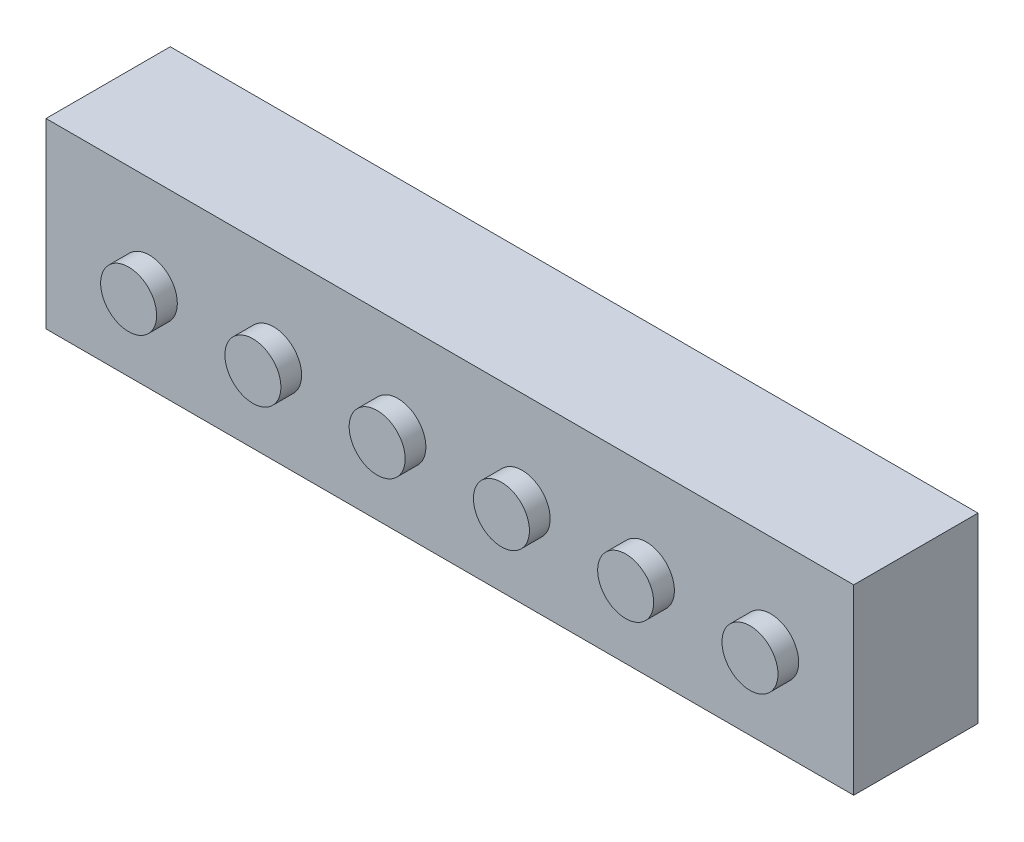
ISO-10303-21;
HEADER;
FILE_DESCRIPTION(('STEP AP214'),'2;1');
FILE_NAME('part.step','',(''),(''),'','','');
FILE_SCHEMA(('AUTOMOTIVE_DESIGN { 1 0 10303 214 1 1 1 1 }'));
ENDSEC;
DATA;
#1=APPLICATION_CONTEXT('core data for automotive mechanical design processes');
#2=APPLICATION_PROTOCOL_DEFINITION('international standard','automotive_design',2000,#1);
#3=PRODUCT_CONTEXT('',#1,'mechanical');
#4=PRODUCT('Part','Part','',(#3));
#5=PRODUCT_RELATED_PRODUCT_CATEGORY('part','',(#4));
#6=PRODUCT_DEFINITION_FORMATION('','',#4);
#7=PRODUCT_DEFINITION_CONTEXT('part definition',#1,'design');
#8=PRODUCT_DEFINITION('design','',#6,#7);
#9=PRODUCT_DEFINITION_SHAPE('','',#8);
#10=(LENGTH_UNIT() NAMED_UNIT(*) SI_UNIT(.MILLI.,.METRE.));
#11=(NAMED_UNIT(*) PLANE_ANGLE_UNIT() SI_UNIT($,.RADIAN.));
#12=(NAMED_UNIT(*) SI_UNIT($,.STERADIAN.) SOLID_ANGLE_UNIT());
#13=UNCERTAINTY_MEASURE_WITH_UNIT(LENGTH_MEASURE(1.E-05),#10,'distance_accuracy_value','');
#14=(GEOMETRIC_REPRESENTATION_CONTEXT(3) GLOBAL_UNCERTAINTY_ASSIGNED_CONTEXT((#13)) GLOBAL_UNIT_ASSIGNED_CONTEXT((#10,
#11,#12)) REPRESENTATION_CONTEXT('',''));
#15=CARTESIAN_POINT('',(0.,0.,0.));
#16=DIRECTION('',(0.,0.,1.));
#17=DIRECTION('',(1.,0.,0.));
#18=AXIS2_PLACEMENT_3D('',#15,#16,#17);
#19=CARTESIAN_POINT('',(157.430504542612,17.7049994128948,70.));
#20=DIRECTION('',(0.,0.,1.));
#21=DIRECTION('',(1.,0.,0.));
#22=AXIS2_PLACEMENT_3D('',#19,#20,#21);
#23=PLANE('',#22);
#24=CARTESIAN_POINT('',(157.430504542612,17.7049994128948,70.));
#25=DIRECTION('',(0.,0.,1.));
#26=DIRECTION('',(1.,0.,0.));
#27=AXIS2_PLACEMENT_3D('',#24,#25,#26);
#28=CIRCLE('',#27,13.5201178452894);
#29=CARTESIAN_POINT('',(170.950622387902,17.7049994128948,70.));
#30=VERTEX_POINT('',#29);
#31=EDGE_CURVE('E11',#30,#30,#28,.T.);
#32=ORIENTED_EDGE('',*,*,#31,.T.);
#33=EDGE_LOOP('',(#32));
#34=FACE_BOUND('',#33,.T.);
#35=ADVANCED_FACE('F39',(#34),#23,.T.);
#36=CARTESIAN_POINT('',(157.430504542612,17.7049994128948,70.));
#37=DIRECTION('',(0.,0.,-1.));
#38=DIRECTION('',(-1.,0.,0.));
#39=AXIS2_PLACEMENT_3D('',#36,#37,#38);
#40=CYLINDRICAL_SURFACE('',#39,13.5201178452894);
#41=ORIENTED_EDGE('',*,*,#31,.F.);
#42=EDGE_LOOP('',(#41));
#43=FACE_BOUND('',#42,.T.);
#44=CARTESIAN_POINT('',(157.430504542612,17.7049994128948,60.));
#45=DIRECTION('',(0.,0.,1.));
#46=DIRECTION('',(1.,0.,0.));
#47=AXIS2_PLACEMENT_3D('',#44,#45,#46);
#48=CIRCLE('',#47,13.5201178452894);
#49=CARTESIAN_POINT('',(170.950622387902,17.7049994128948,60.));
#50=VERTEX_POINT('',#49);
#51=EDGE_CURVE('E48',#50,#50,#48,.T.);
#52=ORIENTED_EDGE('',*,*,#51,.T.);
#53=EDGE_LOOP('',(#52));
#54=FACE_BOUND('',#53,.T.);
#55=ADVANCED_FACE('F156',(#43,#54),#40,.T.);
#56=CARTESIAN_POINT('',(97.4305045426122,17.7049994128948,70.));
#57=DIRECTION('',(0.,0.,1.));
#58=DIRECTION('',(1.,0.,0.));
#59=AXIS2_PLACEMENT_3D('',#56,#57,#58);
#60=PLANE('',#59);
#61=CARTESIAN_POINT('',(97.4305045426122,17.7049994128948,70.));
#62=DIRECTION('',(0.,0.,1.));
#63=DIRECTION('',(1.,0.,0.));
#64=AXIS2_PLACEMENT_3D('',#61,#62,#63);
#65=CIRCLE('',#64,13.5201178452894);
#66=CARTESIAN_POINT('',(110.950622387902,17.7049994128948,70.));
#67=VERTEX_POINT('',#66);
#68=EDGE_CURVE('E149',#67,#67,#65,.T.);
#69=ORIENTED_EDGE('',*,*,#68,.T.);
#70=EDGE_LOOP('',(#69));
#71=FACE_BOUND('',#70,.T.);
#72=ADVANCED_FACE('F179',(#71),#60,.T.);
#73=CARTESIAN_POINT('',(97.4305045426122,17.7049994128948,70.));
#74=DIRECTION('',(0.,0.,-1.));
#75=DIRECTION('',(-1.,0.,0.));
#76=AXIS2_PLACEMENT_3D('',#73,#74,#75);
#77=CYLINDRICAL_SURFACE('',#76,13.5201178452894);
#78=ORIENTED_EDGE('',*,*,#68,.F.);
#79=EDGE_LOOP('',(#78));
#80=FACE_BOUND('',#79,.T.);
#81=CARTESIAN_POINT('',(97.4305045426122,17.7049994128948,60.));
#82=DIRECTION('',(0.,0.,1.));
#83=DIRECTION('',(1.,0.,0.));
#84=AXIS2_PLACEMENT_3D('',#81,#82,#83);
#85=CIRCLE('',#84,13.5201178452894);
#86=CARTESIAN_POINT('',(110.950622387902,17.7049994128948,60.));
#87=VERTEX_POINT('',#86);
#88=EDGE_CURVE('E145',#87,#87,#85,.T.);
#89=ORIENTED_EDGE('',*,*,#88,.T.);
#90=EDGE_LOOP('',(#89));
#91=FACE_BOUND('',#90,.T.);
#92=ADVANCED_FACE('F185',(#80,#91),#77,.T.);
#93=CARTESIAN_POINT('',(37.4305045426122,17.7049994128948,70.));
#94=DIRECTION('',(0.,0.,1.));
#95=DIRECTION('',(1.,0.,0.));
#96=AXIS2_PLACEMENT_3D('',#93,#94,#95);
#97=PLANE('',#96);
#98=CARTESIAN_POINT('',(37.4305045426122,17.7049994128948,70.));
#99=DIRECTION('',(0.,0.,1.));
#100=DIRECTION('',(1.,0.,0.));
#101=AXIS2_PLACEMENT_3D('',#98,#99,#100);
#102=CIRCLE('',#101,13.5201178452894);
#103=CARTESIAN_POINT('',(50.9506223879016,17.7049994128948,70.));
#104=VERTEX_POINT('',#103);
#105=EDGE_CURVE('E141',#104,#104,#102,.T.);
#106=ORIENTED_EDGE('',*,*,#105,.T.);
#107=EDGE_LOOP('',(#106));
#108=FACE_BOUND('',#107,.T.);
#109=ADVANCED_FACE('F191',(#108),#97,.T.);
#110=CARTESIAN_POINT('',(37.4305045426122,17.7049994128948,70.));
#111=DIRECTION('',(0.,0.,-1.));
#112=DIRECTION('',(-1.,0.,0.));
#113=AXIS2_PLACEMENT_3D('',#110,#111,#112);
#114=CYLINDRICAL_SURFACE('',#113,13.5201178452894);
#115=ORIENTED_EDGE('',*,*,#105,.F.);
#116=EDGE_LOOP('',(#115));
#117=FACE_BOUND('',#116,.T.);
#118=CARTESIAN_POINT('',(37.4305045426122,17.7049994128948,60.));
#119=DIRECTION('',(0.,0.,1.));
#120=DIRECTION('',(1.,0.,0.));
#121=AXIS2_PLACEMENT_3D('',#118,#119,#120);
#122=CIRCLE('',#121,13.5201178452894);
#123=CARTESIAN_POINT('',(50.9506223879016,17.7049994128948,60.));
#124=VERTEX_POINT('',#123);
#125=EDGE_CURVE('E137',#124,#124,#122,.T.);
#126=ORIENTED_EDGE('',*,*,#125,.T.);
#127=EDGE_LOOP('',(#126));
#128=FACE_BOUND('',#127,.T.);
#129=ADVANCED_FACE('F195',(#117,#128),#114,.T.);
#130=CARTESIAN_POINT('',(-22.5694954573878,17.7049994128948,70.));
#131=DIRECTION('',(0.,0.,1.));
#132=DIRECTION('',(1.,0.,0.));
#133=AXIS2_PLACEMENT_3D('',#130,#131,#132);
#134=PLANE('',#133);
#135=CARTESIAN_POINT('',(-22.5694954573878,17.7049994128948,70.));
#136=DIRECTION('',(0.,0.,1.));
#137=DIRECTION('',(1.,0.,0.));
#138=AXIS2_PLACEMENT_3D('',#135,#136,#137);
#139=CIRCLE('',#138,13.5201178452894);
#140=CARTESIAN_POINT('',(-9.04937761209837,17.7049994128948,70.));
#141=VERTEX_POINT('',#140);
#142=EDGE_CURVE('E133',#141,#141,#139,.T.);
#143=ORIENTED_EDGE('',*,*,#142,.T.);
#144=EDGE_LOOP('',(#143));
#145=FACE_BOUND('',#144,.T.);
#146=ADVANCED_FACE('F199',(#145),#134,.T.);
#147=CARTESIAN_POINT('',(-22.5694954573878,17.7049994128948,70.));
#148=DIRECTION('',(0.,0.,-1.));
#149=DIRECTION('',(-1.,0.,0.));
#150=AXIS2_PLACEMENT_3D('',#147,#148,#149);
#151=CYLINDRICAL_SURFACE('',#150,13.5201178452894);
#152=ORIENTED_EDGE('',*,*,#142,.F.);
#153=EDGE_LOOP('',(#152));
#154=FACE_BOUND('',#153,.T.);
#155=CARTESIAN_POINT('',(-22.5694954573878,17.7049994128948,60.));
#156=DIRECTION('',(0.,0.,1.));
#157=DIRECTION('',(1.,0.,0.));
#158=AXIS2_PLACEMENT_3D('',#155,#156,#157);
#159=CIRCLE('',#158,13.5201178452894);
#160=CARTESIAN_POINT('',(-9.04937761209837,17.7049994128948,60.));
#161=VERTEX_POINT('',#160);
#162=EDGE_CURVE('E129',#161,#161,#159,.T.);
#163=ORIENTED_EDGE('',*,*,#162,.T.);
#164=EDGE_LOOP('',(#163));
#165=FACE_BOUND('',#164,.T.);
#166=ADVANCED_FACE('F203',(#154,#165),#151,.T.);
#167=CARTESIAN_POINT('',(-192.465,63.375,60.));
#168=DIRECTION('',(1.,0.,0.));
#169=DIRECTION('',(0.,0.,-1.));
#170=AXIS2_PLACEMENT_3D('',#167,#168,#169);
#171=PLANE('',#170);
#172=DIRECTION('',(0.,-1.,0.));
#173=VECTOR('',#172,1.);
#174=CARTESIAN_POINT('',(-192.465,63.375,0.));
#175=LINE('',#174,#173);
#176=CARTESIAN_POINT('',(-192.465,63.375,0.));
#177=VERTEX_POINT('',#176);
#178=CARTESIAN_POINT('',(-192.465,-24.625,0.));
#179=VERTEX_POINT('',#178);
#180=EDGE_CURVE('E112',#177,#179,#175,.T.);
#181=ORIENTED_EDGE('',*,*,#180,.T.);
#182=DIRECTION('',(0.,0.,-1.));
#183=VECTOR('',#182,1.);
#184=CARTESIAN_POINT('',(-192.465,-24.625,60.));
#185=LINE('',#184,#183);
#186=CARTESIAN_POINT('',(-192.465,-24.625,60.));
#187=VERTEX_POINT('',#186);
#188=EDGE_CURVE('E101',#187,#179,#185,.T.);
#189=ORIENTED_EDGE('',*,*,#188,.F.);
#190=DIRECTION('',(0.,-1.,0.));
#191=VECTOR('',#190,1.);
#192=CARTESIAN_POINT('',(-192.465,63.375,60.));
#193=LINE('',#192,#191);
#194=CARTESIAN_POINT('',(-192.465,63.375,60.));
#195=VERTEX_POINT('',#194);
#196=EDGE_CURVE('E93',#195,#187,#193,.T.);
#197=ORIENTED_EDGE('',*,*,#196,.F.);
#198=DIRECTION('',(0.,0.,-1.));
#199=VECTOR('',#198,1.);
#200=CARTESIAN_POINT('',(-192.465,63.375,60.));
#201=LINE('',#200,#199);
#202=EDGE_CURVE('E108',#195,#177,#201,.T.);
#203=ORIENTED_EDGE('',*,*,#202,.T.);
#204=EDGE_LOOP('',(#181,#189,#197,#203));
#205=FACE_BOUND('',#204,.T.);
#206=ADVANCED_FACE('F207',(#205),#171,.F.);
#207=CARTESIAN_POINT('',(-192.465,-24.625,60.));
#208=DIRECTION('',(0.,1.,0.));
#209=DIRECTION('',(0.,0.,1.));
#210=AXIS2_PLACEMENT_3D('',#207,#208,#209);
#211=PLANE('',#210);
#212=DIRECTION('',(1.,0.,0.));
#213=VECTOR('',#212,1.);
#214=CARTESIAN_POINT('',(-192.465,-24.625,0.));
#215=LINE('',#214,#213);
#216=CARTESIAN_POINT('',(197.535,-24.625,0.));
#217=VERTEX_POINT('',#216);
#218=EDGE_CURVE('E99',#179,#217,#215,.T.);
#219=ORIENTED_EDGE('',*,*,#218,.T.);
#220=DIRECTION('',(0.,0.,-1.));
#221=VECTOR('',#220,1.);
#222=CARTESIAN_POINT('',(197.535,-24.625,60.));
#223=LINE('',#222,#221);
#224=CARTESIAN_POINT('',(197.535,-24.625,60.));
#225=VERTEX_POINT('',#224);
#226=EDGE_CURVE('E97',#225,#217,#223,.T.);
#227=ORIENTED_EDGE('',*,*,#226,.F.);
#228=DIRECTION('',(1.,0.,0.));
#229=VECTOR('',#228,1.);
#230=CARTESIAN_POINT('',(-192.465,-24.625,60.));
#231=LINE('',#230,#229);
#232=EDGE_CURVE('E87',#187,#225,#231,.T.);
#233=ORIENTED_EDGE('',*,*,#232,.F.);
#234=ORIENTED_EDGE('',*,*,#188,.T.);
#235=EDGE_LOOP('',(#219,#227,#233,#234));
#236=FACE_BOUND('',#235,.T.);
#237=ADVANCED_FACE('F98',(#236),#211,.F.);
#238=CARTESIAN_POINT('',(197.535,63.375,60.));
#239=DIRECTION('',(-1.,0.,0.));
#240=DIRECTION('',(0.,0.,1.));
#241=AXIS2_PLACEMENT_3D('',#238,#239,#240);
#242=PLANE('',#241);
#243=DIRECTION('',(0.,1.,0.));
#244=VECTOR('',#243,1.);
#245=CARTESIAN_POINT('',(197.535,63.375,0.));
#246=LINE('',#245,#244);
#247=CARTESIAN_POINT('',(197.535,63.375,0.));
#248=VERTEX_POINT('',#247);
#249=EDGE_CURVE('E73',#217,#248,#246,.T.);
#250=ORIENTED_EDGE('',*,*,#249,.T.);
#251=DIRECTION('',(0.,0.,-1.));
#252=VECTOR('',#251,1.);
#253=CARTESIAN_POINT('',(197.535,63.375,60.));
#254=LINE('',#253,#252);
#255=CARTESIAN_POINT('',(197.535,63.375,60.));
#256=VERTEX_POINT('',#255);
#257=EDGE_CURVE('E102',#256,#248,#254,.T.);
#258=ORIENTED_EDGE('',*,*,#257,.F.);
#259=DIRECTION('',(0.,1.,0.));
#260=VECTOR('',#259,1.);
#261=CARTESIAN_POINT('',(197.535,63.375,60.));
#262=LINE('',#261,#260);
#263=EDGE_CURVE('E91',#225,#256,#262,.T.);
#264=ORIENTED_EDGE('',*,*,#263,.F.);
#265=ORIENTED_EDGE('',*,*,#226,.T.);
#266=EDGE_LOOP('',(#250,#258,#264,#265));
#267=FACE_BOUND('',#266,.T.);
#268=ADVANCED_FACE('F104',(#267),#242,.F.);
#269=CARTESIAN_POINT('',(-192.465,63.375,60.));
#270=DIRECTION('',(0.,-1.,0.));
#271=DIRECTION('',(0.,0.,-1.));
#272=AXIS2_PLACEMENT_3D('',#269,#270,#271);
#273=PLANE('',#272);
#274=DIRECTION('',(-1.,0.,0.));
#275=VECTOR('',#274,1.);
#276=CARTESIAN_POINT('',(-192.465,63.375,0.));
#277=LINE('',#276,#275);
#278=EDGE_CURVE('E79',#248,#177,#277,.T.);
#279=ORIENTED_EDGE('',*,*,#278,.T.);
#280=ORIENTED_EDGE('',*,*,#202,.F.);
#281=DIRECTION('',(-1.,0.,0.));
#282=VECTOR('',#281,1.);
#283=CARTESIAN_POINT('',(-192.465,63.375,60.));
#284=LINE('',#283,#282);
#285=EDGE_CURVE('E56',#256,#195,#284,.T.);
#286=ORIENTED_EDGE('',*,*,#285,.F.);
#287=ORIENTED_EDGE('',*,*,#257,.T.);
#288=EDGE_LOOP('',(#279,#280,#286,#287));
#289=FACE_BOUND('',#288,.T.);
#290=ADVANCED_FACE('F160',(#289),#273,.F.);
#291=CARTESIAN_POINT('',(0.,0.,60.));
#292=DIRECTION('',(0.,0.,1.));
#293=DIRECTION('',(1.,0.,0.));
#294=AXIS2_PLACEMENT_3D('',#291,#292,#293);
#295=PLANE('',#294);
#296=CARTESIAN_POINT('',(-82.5694954573878,17.7049994128948,60.));
#297=DIRECTION('',(0.,0.,1.));
#298=DIRECTION('',(1.,0.,0.));
#299=AXIS2_PLACEMENT_3D('',#296,#297,#298);
#300=CIRCLE('',#299,13.5201178452894);
#301=CARTESIAN_POINT('',(-69.0493776120984,17.7049994128948,60.));
#302=VERTEX_POINT('',#301);
#303=EDGE_CURVE('E324',#302,#302,#300,.T.);
#304=ORIENTED_EDGE('',*,*,#303,.F.);
#305=EDGE_LOOP('',(#304));
#306=FACE_BOUND('',#305,.T.);
#307=CARTESIAN_POINT('',(-142.569495457388,17.7049994128948,60.));
#308=DIRECTION('',(0.,0.,1.));
#309=DIRECTION('',(1.,0.,0.));
#310=AXIS2_PLACEMENT_3D('',#307,#308,#309);
#311=CIRCLE('',#310,13.5201178452894);
#312=CARTESIAN_POINT('',(-129.049377612098,17.7049994128948,60.));
#313=VERTEX_POINT('',#312);
#314=EDGE_CURVE('E323',#313,#313,#311,.T.);
#315=ORIENTED_EDGE('',*,*,#314,.F.);
#316=EDGE_LOOP('',(#315));
#317=FACE_BOUND('',#316,.T.);
#318=ORIENTED_EDGE('',*,*,#196,.T.);
#319=ORIENTED_EDGE('',*,*,#232,.T.);
#320=ORIENTED_EDGE('',*,*,#263,.T.);
#321=ORIENTED_EDGE('',*,*,#285,.T.);
#322=EDGE_LOOP('',(#318,#319,#320,#321));
#323=FACE_BOUND('',#322,.T.);
#324=ORIENTED_EDGE('',*,*,#162,.F.);
#325=EDGE_LOOP('',(#324));
#326=FACE_BOUND('',#325,.T.);
#327=ORIENTED_EDGE('',*,*,#125,.F.);
#328=EDGE_LOOP('',(#327));
#329=FACE_BOUND('',#328,.T.);
#330=ORIENTED_EDGE('',*,*,#88,.F.);
#331=EDGE_LOOP('',(#330));
#332=FACE_BOUND('',#331,.T.);
#333=ORIENTED_EDGE('',*,*,#51,.F.);
#334=EDGE_LOOP('',(#333));
#335=FACE_BOUND('',#334,.T.);
#336=ADVANCED_FACE('F88',(#306,#317,#323,#326,#329,#332,#335),#295,.T.);
#337=CARTESIAN_POINT('',(0.,0.,0.));
#338=DIRECTION('',(0.,0.,1.));
#339=DIRECTION('',(1.,0.,0.));
#340=AXIS2_PLACEMENT_3D('',#337,#338,#339);
#341=PLANE('',#340);
#342=ORIENTED_EDGE('',*,*,#180,.F.);
#343=ORIENTED_EDGE('',*,*,#278,.F.);
#344=ORIENTED_EDGE('',*,*,#249,.F.);
#345=ORIENTED_EDGE('',*,*,#218,.F.);
#346=EDGE_LOOP('',(#342,#343,#344,#345));
#347=FACE_BOUND('',#346,.T.);
#348=ADVANCED_FACE('F159',(#347),#341,.F.);
#349=CARTESIAN_POINT('',(-142.569495457388,17.7049994128948,70.));
#350=DIRECTION('',(0.,0.,-1.));
#351=DIRECTION('',(-1.,0.,0.));
#352=AXIS2_PLACEMENT_3D('',#349,#350,#351);
#353=CYLINDRICAL_SURFACE('',#352,13.5201178452894);
#354=CARTESIAN_POINT('',(-142.569495457388,17.7049994128948,70.));
#355=DIRECTION('',(0.,0.,1.));
#356=DIRECTION('',(1.,0.,0.));
#357=AXIS2_PLACEMENT_3D('',#354,#355,#356);
#358=CIRCLE('',#357,13.5201178452894);
#359=CARTESIAN_POINT('',(-129.049377612098,17.7049994128948,70.));
#360=VERTEX_POINT('',#359);
#361=EDGE_CURVE('E116',#360,#360,#358,.T.);
#362=ORIENTED_EDGE('',*,*,#361,.F.);
#363=EDGE_LOOP('',(#362));
#364=FACE_BOUND('',#363,.T.);
#365=ORIENTED_EDGE('',*,*,#314,.T.);
#366=EDGE_LOOP('',(#365));
#367=FACE_BOUND('',#366,.T.);
#368=ADVANCED_FACE('F167',(#364,#367),#353,.T.);
#369=CARTESIAN_POINT('',(-142.569495457388,17.7049994128948,70.));
#370=DIRECTION('',(0.,0.,1.));
#371=DIRECTION('',(1.,0.,0.));
#372=AXIS2_PLACEMENT_3D('',#369,#370,#371);
#373=PLANE('',#372);
#374=ORIENTED_EDGE('',*,*,#361,.T.);
#375=EDGE_LOOP('',(#374));
#376=FACE_BOUND('',#375,.T.);
#377=ADVANCED_FACE('F239',(#376),#373,.T.);
#378=CARTESIAN_POINT('',(-82.5694954573878,17.7049994128948,70.));
#379=DIRECTION('',(0.,0.,-1.));
#380=DIRECTION('',(-1.,0.,0.));
#381=AXIS2_PLACEMENT_3D('',#378,#379,#380);
#382=CYLINDRICAL_SURFACE('',#381,13.5201178452894);
#383=CARTESIAN_POINT('',(-82.5694954573878,17.7049994128948,70.));
#384=DIRECTION('',(0.,0.,1.));
#385=DIRECTION('',(1.,0.,0.));
#386=AXIS2_PLACEMENT_3D('',#383,#384,#385);
#387=CIRCLE('',#386,13.5201178452894);
#388=CARTESIAN_POINT('',(-69.0493776120984,17.7049994128948,70.));
#389=VERTEX_POINT('',#388);
#390=EDGE_CURVE('E321',#389,#389,#387,.T.);
#391=ORIENTED_EDGE('',*,*,#390,.F.);
#392=EDGE_LOOP('',(#391));
#393=FACE_BOUND('',#392,.T.);
#394=ORIENTED_EDGE('',*,*,#303,.T.);
#395=EDGE_LOOP('',(#394));
#396=FACE_BOUND('',#395,.T.);
#397=ADVANCED_FACE('F247',(#393,#396),#382,.T.);
#398=CARTESIAN_POINT('',(-82.5694954573878,17.7049994128948,70.));
#399=DIRECTION('',(0.,0.,1.));
#400=DIRECTION('',(1.,0.,0.));
#401=AXIS2_PLACEMENT_3D('',#398,#399,#400);
#402=PLANE('',#401);
#403=ORIENTED_EDGE('',*,*,#390,.T.);
#404=EDGE_LOOP('',(#403));
#405=FACE_BOUND('',#404,.T.);
#406=ADVANCED_FACE('F305',(#405),#402,.T.);
#407=CLOSED_SHELL('',(#35,#55,#72,#92,#109,#129,#146,#166,#206,#237,#268,#290,#336,#348,#368,
#377,#397,#406));
#408=MANIFOLD_SOLID_BREP('B2',#407);
#409=ADVANCED_BREP_SHAPE_REPRESENTATION('',(#18,#408),#14);
#410=SHAPE_DEFINITION_REPRESENTATION(#9,#409);
ENDSEC;
END-ISO-10303-21;
